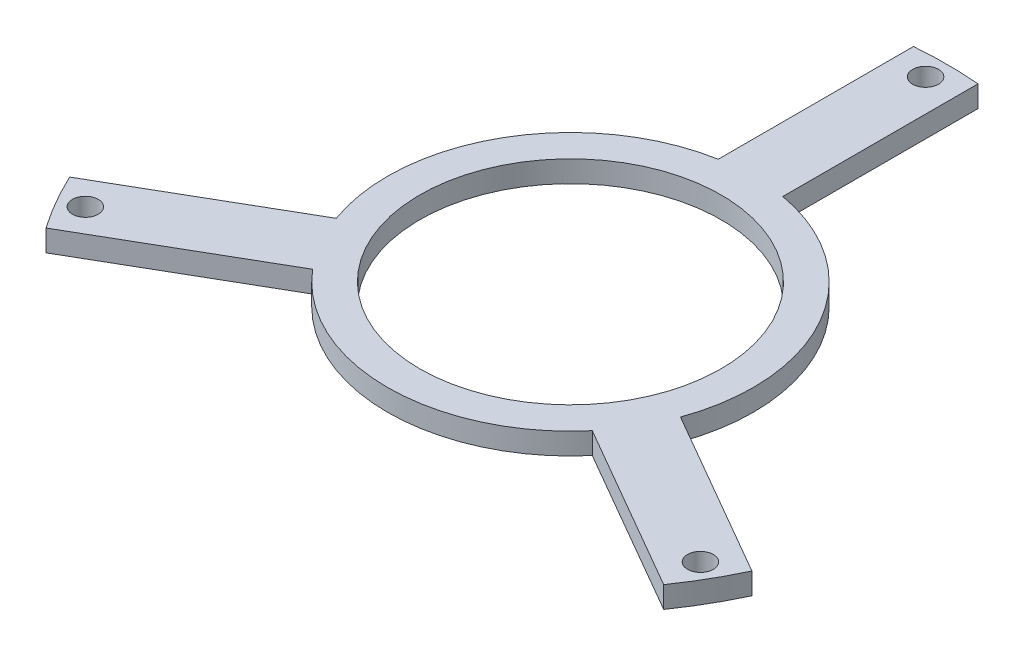
ISO-10303-21;
HEADER;
FILE_DESCRIPTION(('STEP AP214'),'2;1');
FILE_NAME('part.step','',(''),(''),'','','');
FILE_SCHEMA(('AUTOMOTIVE_DESIGN { 1 0 10303 214 1 1 1 1 }'));
ENDSEC;
DATA;
#1=APPLICATION_CONTEXT('core data for automotive mechanical design processes');
#2=APPLICATION_PROTOCOL_DEFINITION('international standard','automotive_design',2000,#1);
#3=PRODUCT_CONTEXT('',#1,'mechanical');
#4=PRODUCT('Part','Part','',(#3));
#5=PRODUCT_RELATED_PRODUCT_CATEGORY('part','',(#4));
#6=PRODUCT_DEFINITION_FORMATION('','',#4);
#7=PRODUCT_DEFINITION_CONTEXT('part definition',#1,'design');
#8=PRODUCT_DEFINITION('design','',#6,#7);
#9=PRODUCT_DEFINITION_SHAPE('','',#8);
#10=(LENGTH_UNIT() NAMED_UNIT(*) SI_UNIT(.MILLI.,.METRE.));
#11=(NAMED_UNIT(*) PLANE_ANGLE_UNIT() SI_UNIT($,.RADIAN.));
#12=(NAMED_UNIT(*) SI_UNIT($,.STERADIAN.) SOLID_ANGLE_UNIT());
#13=UNCERTAINTY_MEASURE_WITH_UNIT(LENGTH_MEASURE(1.E-05),#10,'distance_accuracy_value','');
#14=(GEOMETRIC_REPRESENTATION_CONTEXT(3) GLOBAL_UNCERTAINTY_ASSIGNED_CONTEXT((#13)) GLOBAL_UNIT_ASSIGNED_CONTEXT((#10,
#11,#12)) REPRESENTATION_CONTEXT('',''));
#15=CARTESIAN_POINT('',(0.,0.,0.));
#16=DIRECTION('',(0.,0.,1.));
#17=DIRECTION('',(1.,0.,0.));
#18=AXIS2_PLACEMENT_3D('',#15,#16,#17);
#19=CARTESIAN_POINT('',(0.,10.,0.));
#20=DIRECTION('',(0.,1.,0.));
#21=DIRECTION('',(0.,0.,1.));
#22=AXIS2_PLACEMENT_3D('',#19,#20,#21);
#23=PLANE('',#22);
#24=CARTESIAN_POINT('',(142.894191624441,10.,82.4999999999948));
#25=DIRECTION('',(0.,1.,0.));
#26=DIRECTION('',(0.,0.,1.));
#27=AXIS2_PLACEMENT_3D('',#24,#25,#26);
#28=CIRCLE('',#27,6.00000000000002);
#29=CARTESIAN_POINT('',(142.894191624441,10.,88.4999999999949));
#30=VERTEX_POINT('',#29);
#31=EDGE_CURVE('E294',#30,#30,#28,.T.);
#32=ORIENTED_EDGE('',*,*,#31,.F.);
#33=EDGE_LOOP('',(#32));
#34=FACE_BOUND('',#33,.T.);
#35=CARTESIAN_POINT('',(0.,10.,0.));
#36=DIRECTION('',(0.,1.,0.));
#37=DIRECTION('',(0.,0.,1.));
#38=AXIS2_PLACEMENT_3D('',#35,#36,#37);
#39=CIRCLE('',#38,70.);
#40=CARTESIAN_POINT('',(0.,10.,70.));
#41=VERTEX_POINT('',#40);
#42=EDGE_CURVE('E160',#41,#41,#39,.T.);
#43=ORIENTED_EDGE('',*,*,#42,.F.);
#44=EDGE_LOOP('',(#43));
#45=FACE_BOUND('',#44,.T.);
#46=CARTESIAN_POINT('',(0.,10.,0.));
#47=DIRECTION('',(0.,1.,0.));
#48=DIRECTION('',(0.,0.,1.));
#49=AXIS2_PLACEMENT_3D('',#46,#47,#48);
#50=CIRCLE('',#49,85.);
#51=CARTESIAN_POINT('',(79.9568837309492,10.,28.8426202699317));
#52=VERTEX_POINT('',#51);
#53=CARTESIAN_POINT('',(15.,10.,-83.6660026534076));
#54=VERTEX_POINT('',#53);
#55=EDGE_CURVE('E179',#52,#54,#50,.T.);
#56=ORIENTED_EDGE('',*,*,#55,.T.);
#57=DIRECTION('',(0.,0.,-1.));
#58=VECTOR('',#57,1.);
#59=CARTESIAN_POINT('',(15.,10.,-174.355957741627));
#60=LINE('',#59,#58);
#61=CARTESIAN_POINT('',(15.,10.,-174.355957741627));
#62=VERTEX_POINT('',#61);
#63=EDGE_CURVE('E107',#54,#62,#60,.T.);
#64=ORIENTED_EDGE('',*,*,#63,.T.);
#65=CARTESIAN_POINT('',(0.,10.,0.));
#66=DIRECTION('',(0.,1.,0.));
#67=DIRECTION('',(0.,0.,1.));
#68=AXIS2_PLACEMENT_3D('',#65,#66,#67);
#69=CIRCLE('',#68,175.);
#70=CARTESIAN_POINT('',(-15.,10.,-174.355957741627));
#71=VERTEX_POINT('',#70);
#72=EDGE_CURVE('E206',#62,#71,#69,.T.);
#73=ORIENTED_EDGE('',*,*,#72,.T.);
#74=DIRECTION('',(0.,0.,1.));
#75=VECTOR('',#74,1.);
#76=CARTESIAN_POINT('',(-15.,10.,-174.355957741627));
#77=LINE('',#76,#75);
#78=CARTESIAN_POINT('',(-15.,10.,-83.6660026534076));
#79=VERTEX_POINT('',#78);
#80=EDGE_CURVE('E225',#71,#79,#77,.T.);
#81=ORIENTED_EDGE('',*,*,#80,.T.);
#82=CARTESIAN_POINT('',(0.,10.,0.));
#83=DIRECTION('',(0.,1.,0.));
#84=DIRECTION('',(0.,0.,1.));
#85=AXIS2_PLACEMENT_3D('',#82,#83,#84);
#86=CIRCLE('',#85,85.);
#87=CARTESIAN_POINT('',(-79.9568837309453,10.,28.8426202699424));
#88=VERTEX_POINT('',#87);
#89=EDGE_CURVE('E222',#79,#88,#86,.T.);
#90=ORIENTED_EDGE('',*,*,#89,.T.);
#91=DIRECTION('',(-0.866025403784439,0.,0.5));
#92=VECTOR('',#91,1.);
#93=CARTESIAN_POINT('',(-158.496688705413,10.,74.1875978140519));
#94=LINE('',#93,#92);
#95=CARTESIAN_POINT('',(-158.496688705413,10.,74.1875978140519));
#96=VERTEX_POINT('',#95);
#97=EDGE_CURVE('E224',#88,#96,#94,.T.);
#98=ORIENTED_EDGE('',*,*,#97,.T.);
#99=CARTESIAN_POINT('',(0.,10.,0.));
#100=DIRECTION('',(0.,1.,0.));
#101=DIRECTION('',(0.,0.,1.));
#102=AXIS2_PLACEMENT_3D('',#99,#100,#101);
#103=CIRCLE('',#102,175.);
#104=CARTESIAN_POINT('',(-143.496688705412,10.,100.168359927585));
#105=VERTEX_POINT('',#104);
#106=EDGE_CURVE('E227',#96,#105,#103,.T.);
#107=ORIENTED_EDGE('',*,*,#106,.T.);
#108=DIRECTION('',(0.866025403784439,0.,-0.5));
#109=VECTOR('',#108,1.);
#110=CARTESIAN_POINT('',(-143.496688705412,10.,100.168359927585));
#111=LINE('',#110,#109);
#112=CARTESIAN_POINT('',(-64.9568837309436,10.,54.8233823834746));
#113=VERTEX_POINT('',#112);
#114=EDGE_CURVE('E233',#105,#113,#111,.T.);
#115=ORIENTED_EDGE('',*,*,#114,.T.);
#116=CARTESIAN_POINT('',(0.,10.,0.));
#117=DIRECTION('',(0.,1.,0.));
#118=DIRECTION('',(0.,0.,1.));
#119=AXIS2_PLACEMENT_3D('',#116,#117,#118);
#120=CIRCLE('',#119,85.);
#121=CARTESIAN_POINT('',(64.9568837309509,10.,54.8233823834659));
#122=VERTEX_POINT('',#121);
#123=EDGE_CURVE('E138',#113,#122,#120,.T.);
#124=ORIENTED_EDGE('',*,*,#123,.T.);
#125=DIRECTION('',(0.866025403784439,0.,0.5));
#126=VECTOR('',#125,1.);
#127=CARTESIAN_POINT('',(143.496688705418,10.,100.168359927575));
#128=LINE('',#127,#126);
#129=CARTESIAN_POINT('',(143.496688705418,10.,100.168359927575));
#130=VERTEX_POINT('',#129);
#131=EDGE_CURVE('E132',#122,#130,#128,.T.);
#132=ORIENTED_EDGE('',*,*,#131,.T.);
#133=CARTESIAN_POINT('',(0.,10.,0.));
#134=DIRECTION('',(0.,1.,0.));
#135=DIRECTION('',(0.,0.,1.));
#136=AXIS2_PLACEMENT_3D('',#133,#134,#135);
#137=CIRCLE('',#136,175.);
#138=CARTESIAN_POINT('',(158.496688705417,10.,74.1875978140416));
#139=VERTEX_POINT('',#138);
#140=EDGE_CURVE('E136',#130,#139,#137,.T.);
#141=ORIENTED_EDGE('',*,*,#140,.T.);
#142=DIRECTION('',(-0.866025403784439,0.,-0.5));
#143=VECTOR('',#142,1.);
#144=CARTESIAN_POINT('',(158.496688705417,10.,74.1875978140416));
#145=LINE('',#144,#143);
#146=EDGE_CURVE('E52',#139,#52,#145,.T.);
#147=ORIENTED_EDGE('',*,*,#146,.T.);
#148=EDGE_LOOP('',(#56,#64,#73,#81,#90,#98,#107,#115,#124,#132,#141,#147));
#149=FACE_BOUND('',#148,.T.);
#150=CARTESIAN_POINT('',(0.,10.,-165.));
#151=DIRECTION('',(0.,1.,0.));
#152=DIRECTION('',(0.,0.,1.));
#153=AXIS2_PLACEMENT_3D('',#150,#151,#152);
#154=CIRCLE('',#153,6.);
#155=CARTESIAN_POINT('',(0.,10.,-159.));
#156=VERTEX_POINT('',#155);
#157=EDGE_CURVE('E300',#156,#156,#154,.T.);
#158=ORIENTED_EDGE('',*,*,#157,.F.);
#159=EDGE_LOOP('',(#158));
#160=FACE_BOUND('',#159,.T.);
#161=CARTESIAN_POINT('',(-142.894191624423,10.,82.5000000000052));
#162=DIRECTION('',(0.,1.,0.));
#163=DIRECTION('',(0.,0.,1.));
#164=AXIS2_PLACEMENT_3D('',#161,#162,#163);
#165=CIRCLE('',#164,6.00000000000002);
#166=CARTESIAN_POINT('',(-142.894191624423,10.,88.5000000000052));
#167=VERTEX_POINT('',#166);
#168=EDGE_CURVE('E285',#167,#167,#165,.T.);
#169=ORIENTED_EDGE('',*,*,#168,.F.);
#170=EDGE_LOOP('',(#169));
#171=FACE_BOUND('',#170,.T.);
#172=ADVANCED_FACE('F35',(#34,#45,#149,#160,#171),#23,.T.);
#173=CARTESIAN_POINT('',(0.,0.,0.));
#174=DIRECTION('',(0.,1.,0.));
#175=DIRECTION('',(0.,0.,1.));
#176=AXIS2_PLACEMENT_3D('',#173,#174,#175);
#177=PLANE('',#176);
#178=CARTESIAN_POINT('',(142.894191624441,0.,82.4999999999948));
#179=DIRECTION('',(0.,1.,0.));
#180=DIRECTION('',(0.,0.,1.));
#181=AXIS2_PLACEMENT_3D('',#178,#179,#180);
#182=CIRCLE('',#181,6.00000000000002);
#183=CARTESIAN_POINT('',(142.894191624441,0.,88.4999999999949));
#184=VERTEX_POINT('',#183);
#185=EDGE_CURVE('E291',#184,#184,#182,.T.);
#186=ORIENTED_EDGE('',*,*,#185,.T.);
#187=EDGE_LOOP('',(#186));
#188=FACE_BOUND('',#187,.T.);
#189=CARTESIAN_POINT('',(0.,0.,0.));
#190=DIRECTION('',(0.,1.,0.));
#191=DIRECTION('',(0.,0.,1.));
#192=AXIS2_PLACEMENT_3D('',#189,#190,#191);
#193=CIRCLE('',#192,70.);
#194=CARTESIAN_POINT('',(0.,0.,70.));
#195=VERTEX_POINT('',#194);
#196=EDGE_CURVE('E303',#195,#195,#193,.T.);
#197=ORIENTED_EDGE('',*,*,#196,.T.);
#198=EDGE_LOOP('',(#197));
#199=FACE_BOUND('',#198,.T.);
#200=CARTESIAN_POINT('',(0.,0.,0.));
#201=DIRECTION('',(0.,1.,0.));
#202=DIRECTION('',(0.,0.,1.));
#203=AXIS2_PLACEMENT_3D('',#200,#201,#202);
#204=CIRCLE('',#203,85.);
#205=CARTESIAN_POINT('',(79.9568837309492,0.,28.8426202699317));
#206=VERTEX_POINT('',#205);
#207=CARTESIAN_POINT('',(15.,0.,-83.6660026534076));
#208=VERTEX_POINT('',#207);
#209=EDGE_CURVE('E156',#206,#208,#204,.T.);
#210=ORIENTED_EDGE('',*,*,#209,.F.);
#211=DIRECTION('',(-0.866025403784439,0.,-0.5));
#212=VECTOR('',#211,1.);
#213=CARTESIAN_POINT('',(158.496688705417,0.,74.1875978140416));
#214=LINE('',#213,#212);
#215=CARTESIAN_POINT('',(158.496688705417,0.,74.1875978140416));
#216=VERTEX_POINT('',#215);
#217=EDGE_CURVE('E99',#216,#206,#214,.T.);
#218=ORIENTED_EDGE('',*,*,#217,.F.);
#219=CARTESIAN_POINT('',(0.,0.,0.));
#220=DIRECTION('',(0.,1.,0.));
#221=DIRECTION('',(0.,0.,1.));
#222=AXIS2_PLACEMENT_3D('',#219,#220,#221);
#223=CIRCLE('',#222,175.);
#224=CARTESIAN_POINT('',(143.496688705418,0.,100.168359927575));
#225=VERTEX_POINT('',#224);
#226=EDGE_CURVE('E93',#225,#216,#223,.T.);
#227=ORIENTED_EDGE('',*,*,#226,.F.);
#228=DIRECTION('',(0.866025403784439,0.,0.5));
#229=VECTOR('',#228,1.);
#230=CARTESIAN_POINT('',(143.496688705418,0.,100.168359927575));
#231=LINE('',#230,#229);
#232=CARTESIAN_POINT('',(64.9568837309509,0.,54.8233823834659));
#233=VERTEX_POINT('',#232);
#234=EDGE_CURVE('E146',#233,#225,#231,.T.);
#235=ORIENTED_EDGE('',*,*,#234,.F.);
#236=CARTESIAN_POINT('',(0.,0.,0.));
#237=DIRECTION('',(0.,1.,0.));
#238=DIRECTION('',(0.,0.,1.));
#239=AXIS2_PLACEMENT_3D('',#236,#237,#238);
#240=CIRCLE('',#239,85.);
#241=CARTESIAN_POINT('',(-64.9568837309436,0.,54.8233823834746));
#242=VERTEX_POINT('',#241);
#243=EDGE_CURVE('E174',#242,#233,#240,.T.);
#244=ORIENTED_EDGE('',*,*,#243,.F.);
#245=DIRECTION('',(0.866025403784439,0.,-0.5));
#246=VECTOR('',#245,1.);
#247=CARTESIAN_POINT('',(-143.496688705412,0.,100.168359927585));
#248=LINE('',#247,#246);
#249=CARTESIAN_POINT('',(-143.496688705412,0.,100.168359927585));
#250=VERTEX_POINT('',#249);
#251=EDGE_CURVE('E172',#250,#242,#248,.T.);
#252=ORIENTED_EDGE('',*,*,#251,.F.);
#253=CARTESIAN_POINT('',(0.,0.,0.));
#254=DIRECTION('',(0.,1.,0.));
#255=DIRECTION('',(0.,0.,1.));
#256=AXIS2_PLACEMENT_3D('',#253,#254,#255);
#257=CIRCLE('',#256,175.);
#258=CARTESIAN_POINT('',(-158.496688705413,0.,74.1875978140519));
#259=VERTEX_POINT('',#258);
#260=EDGE_CURVE('E170',#259,#250,#257,.T.);
#261=ORIENTED_EDGE('',*,*,#260,.F.);
#262=DIRECTION('',(-0.866025403784439,0.,0.5));
#263=VECTOR('',#262,1.);
#264=CARTESIAN_POINT('',(-158.496688705413,0.,74.1875978140519));
#265=LINE('',#264,#263);
#266=CARTESIAN_POINT('',(-79.9568837309453,0.,28.8426202699424));
#267=VERTEX_POINT('',#266);
#268=EDGE_CURVE('E168',#267,#259,#265,.T.);
#269=ORIENTED_EDGE('',*,*,#268,.F.);
#270=CARTESIAN_POINT('',(0.,0.,0.));
#271=DIRECTION('',(0.,1.,0.));
#272=DIRECTION('',(0.,0.,1.));
#273=AXIS2_PLACEMENT_3D('',#270,#271,#272);
#274=CIRCLE('',#273,85.);
#275=CARTESIAN_POINT('',(-15.,0.,-83.6660026534076));
#276=VERTEX_POINT('',#275);
#277=EDGE_CURVE('E166',#276,#267,#274,.T.);
#278=ORIENTED_EDGE('',*,*,#277,.F.);
#279=DIRECTION('',(0.,0.,1.));
#280=VECTOR('',#279,1.);
#281=CARTESIAN_POINT('',(-15.,0.,-174.355957741627));
#282=LINE('',#281,#280);
#283=CARTESIAN_POINT('',(-15.,0.,-174.355957741627));
#284=VERTEX_POINT('',#283);
#285=EDGE_CURVE('E164',#284,#276,#282,.T.);
#286=ORIENTED_EDGE('',*,*,#285,.F.);
#287=CARTESIAN_POINT('',(0.,0.,0.));
#288=DIRECTION('',(0.,1.,0.));
#289=DIRECTION('',(0.,0.,1.));
#290=AXIS2_PLACEMENT_3D('',#287,#288,#289);
#291=CIRCLE('',#290,175.);
#292=CARTESIAN_POINT('',(15.,0.,-174.355957741627));
#293=VERTEX_POINT('',#292);
#294=EDGE_CURVE('E162',#293,#284,#291,.T.);
#295=ORIENTED_EDGE('',*,*,#294,.F.);
#296=DIRECTION('',(0.,0.,-1.));
#297=VECTOR('',#296,1.);
#298=CARTESIAN_POINT('',(15.,0.,-174.355957741627));
#299=LINE('',#298,#297);
#300=EDGE_CURVE('E159',#208,#293,#299,.T.);
#301=ORIENTED_EDGE('',*,*,#300,.F.);
#302=EDGE_LOOP('',(#210,#218,#227,#235,#244,#252,#261,#269,#278,#286,#295,#301));
#303=FACE_BOUND('',#302,.T.);
#304=CARTESIAN_POINT('',(0.,0.,-165.));
#305=DIRECTION('',(0.,1.,0.));
#306=DIRECTION('',(0.,0.,1.));
#307=AXIS2_PLACEMENT_3D('',#304,#305,#306);
#308=CIRCLE('',#307,6.);
#309=CARTESIAN_POINT('',(0.,0.,-159.));
#310=VERTEX_POINT('',#309);
#311=EDGE_CURVE('E297',#310,#310,#308,.T.);
#312=ORIENTED_EDGE('',*,*,#311,.T.);
#313=EDGE_LOOP('',(#312));
#314=FACE_BOUND('',#313,.T.);
#315=CARTESIAN_POINT('',(-142.894191624423,0.,82.5000000000052));
#316=DIRECTION('',(0.,1.,0.));
#317=DIRECTION('',(0.,0.,1.));
#318=AXIS2_PLACEMENT_3D('',#315,#316,#317);
#319=CIRCLE('',#318,6.00000000000002);
#320=CARTESIAN_POINT('',(-142.894191624423,0.,88.5000000000052));
#321=VERTEX_POINT('',#320);
#322=EDGE_CURVE('E288',#321,#321,#319,.T.);
#323=ORIENTED_EDGE('',*,*,#322,.T.);
#324=EDGE_LOOP('',(#323));
#325=FACE_BOUND('',#324,.T.);
#326=ADVANCED_FACE('F210',(#188,#199,#303,#314,#325),#177,.F.);
#327=CARTESIAN_POINT('',(0.,10.,0.));
#328=DIRECTION('',(0.,-1.,0.));
#329=DIRECTION('',(0.,0.,-1.));
#330=AXIS2_PLACEMENT_3D('',#327,#328,#329);
#331=CYLINDRICAL_SURFACE('',#330,85.);
#332=ORIENTED_EDGE('',*,*,#209,.T.);
#333=DIRECTION('',(0.,-1.,0.));
#334=VECTOR('',#333,1.);
#335=CARTESIAN_POINT('',(15.,10.,-83.6660026534076));
#336=LINE('',#335,#334);
#337=EDGE_CURVE('E11',#54,#208,#336,.T.);
#338=ORIENTED_EDGE('',*,*,#337,.F.);
#339=ORIENTED_EDGE('',*,*,#55,.F.);
#340=DIRECTION('',(0.,-1.,0.));
#341=VECTOR('',#340,1.);
#342=CARTESIAN_POINT('',(79.9568837309492,10.,28.8426202699317));
#343=LINE('',#342,#341);
#344=EDGE_CURVE('E152',#52,#206,#343,.T.);
#345=ORIENTED_EDGE('',*,*,#344,.T.);
#346=EDGE_LOOP('',(#332,#338,#339,#345));
#347=FACE_BOUND('',#346,.T.);
#348=ADVANCED_FACE('F37',(#347),#331,.T.);
#349=CARTESIAN_POINT('',(15.,10.,-174.355957741627));
#350=DIRECTION('',(-1.,0.,0.));
#351=DIRECTION('',(0.,0.,1.));
#352=AXIS2_PLACEMENT_3D('',#349,#350,#351);
#353=PLANE('',#352);
#354=ORIENTED_EDGE('',*,*,#300,.T.);
#355=DIRECTION('',(0.,-1.,0.));
#356=VECTOR('',#355,1.);
#357=CARTESIAN_POINT('',(15.,10.,-174.355957741627));
#358=LINE('',#357,#356);
#359=EDGE_CURVE('E44',#62,#293,#358,.T.);
#360=ORIENTED_EDGE('',*,*,#359,.F.);
#361=ORIENTED_EDGE('',*,*,#63,.F.);
#362=ORIENTED_EDGE('',*,*,#337,.T.);
#363=EDGE_LOOP('',(#354,#360,#361,#362));
#364=FACE_BOUND('',#363,.T.);
#365=ADVANCED_FACE('F412',(#364),#353,.F.);
#366=CARTESIAN_POINT('',(0.,10.,0.));
#367=DIRECTION('',(0.,-1.,0.));
#368=DIRECTION('',(0.,0.,-1.));
#369=AXIS2_PLACEMENT_3D('',#366,#367,#368);
#370=CYLINDRICAL_SURFACE('',#369,175.);
#371=ORIENTED_EDGE('',*,*,#294,.T.);
#372=DIRECTION('',(0.,-1.,0.));
#373=VECTOR('',#372,1.);
#374=CARTESIAN_POINT('',(-15.,10.,-174.355957741627));
#375=LINE('',#374,#373);
#376=EDGE_CURVE('E198',#71,#284,#375,.T.);
#377=ORIENTED_EDGE('',*,*,#376,.F.);
#378=ORIENTED_EDGE('',*,*,#72,.F.);
#379=ORIENTED_EDGE('',*,*,#359,.T.);
#380=EDGE_LOOP('',(#371,#377,#378,#379));
#381=FACE_BOUND('',#380,.T.);
#382=ADVANCED_FACE('F204',(#381),#370,.T.);
#383=CARTESIAN_POINT('',(-15.,10.,-174.355957741627));
#384=DIRECTION('',(1.,0.,0.));
#385=DIRECTION('',(0.,0.,-1.));
#386=AXIS2_PLACEMENT_3D('',#383,#384,#385);
#387=PLANE('',#386);
#388=ORIENTED_EDGE('',*,*,#285,.T.);
#389=DIRECTION('',(0.,-1.,0.));
#390=VECTOR('',#389,1.);
#391=CARTESIAN_POINT('',(-15.,10.,-83.6660026534076));
#392=LINE('',#391,#390);
#393=EDGE_CURVE('E195',#79,#276,#392,.T.);
#394=ORIENTED_EDGE('',*,*,#393,.F.);
#395=ORIENTED_EDGE('',*,*,#80,.F.);
#396=ORIENTED_EDGE('',*,*,#376,.T.);
#397=EDGE_LOOP('',(#388,#394,#395,#396));
#398=FACE_BOUND('',#397,.T.);
#399=ADVANCED_FACE('F216',(#398),#387,.F.);
#400=CARTESIAN_POINT('',(0.,10.,0.));
#401=DIRECTION('',(0.,-1.,0.));
#402=DIRECTION('',(0.,0.,-1.));
#403=AXIS2_PLACEMENT_3D('',#400,#401,#402);
#404=CYLINDRICAL_SURFACE('',#403,85.);
#405=ORIENTED_EDGE('',*,*,#277,.T.);
#406=DIRECTION('',(0.,-1.,0.));
#407=VECTOR('',#406,1.);
#408=CARTESIAN_POINT('',(-79.9568837309453,10.,28.8426202699424));
#409=LINE('',#408,#407);
#410=EDGE_CURVE('E192',#88,#267,#409,.T.);
#411=ORIENTED_EDGE('',*,*,#410,.F.);
#412=ORIENTED_EDGE('',*,*,#89,.F.);
#413=ORIENTED_EDGE('',*,*,#393,.T.);
#414=EDGE_LOOP('',(#405,#411,#412,#413));
#415=FACE_BOUND('',#414,.T.);
#416=ADVANCED_FACE('F220',(#415),#404,.T.);
#417=CARTESIAN_POINT('',(-158.496688705413,10.,74.1875978140519));
#418=DIRECTION('',(0.5,0.,0.866025403784439));
#419=DIRECTION('',(0.866025403784439,0.,-0.5));
#420=AXIS2_PLACEMENT_3D('',#417,#418,#419);
#421=PLANE('',#420);
#422=ORIENTED_EDGE('',*,*,#268,.T.);
#423=DIRECTION('',(0.,-1.,0.));
#424=VECTOR('',#423,1.);
#425=CARTESIAN_POINT('',(-158.496688705413,10.,74.1875978140519));
#426=LINE('',#425,#424);
#427=EDGE_CURVE('E189',#96,#259,#426,.T.);
#428=ORIENTED_EDGE('',*,*,#427,.F.);
#429=ORIENTED_EDGE('',*,*,#97,.F.);
#430=ORIENTED_EDGE('',*,*,#410,.T.);
#431=EDGE_LOOP('',(#422,#428,#429,#430));
#432=FACE_BOUND('',#431,.T.);
#433=ADVANCED_FACE('F377',(#432),#421,.F.);
#434=CARTESIAN_POINT('',(0.,10.,0.));
#435=DIRECTION('',(0.,-1.,0.));
#436=DIRECTION('',(0.,0.,-1.));
#437=AXIS2_PLACEMENT_3D('',#434,#435,#436);
#438=CYLINDRICAL_SURFACE('',#437,175.);
#439=ORIENTED_EDGE('',*,*,#260,.T.);
#440=DIRECTION('',(0.,-1.,0.));
#441=VECTOR('',#440,1.);
#442=CARTESIAN_POINT('',(-143.496688705412,10.,100.168359927585));
#443=LINE('',#442,#441);
#444=EDGE_CURVE('E186',#105,#250,#443,.T.);
#445=ORIENTED_EDGE('',*,*,#444,.F.);
#446=ORIENTED_EDGE('',*,*,#106,.F.);
#447=ORIENTED_EDGE('',*,*,#427,.T.);
#448=EDGE_LOOP('',(#439,#445,#446,#447));
#449=FACE_BOUND('',#448,.T.);
#450=ADVANCED_FACE('F368',(#449),#438,.T.);
#451=CARTESIAN_POINT('',(-143.496688705412,10.,100.168359927585));
#452=DIRECTION('',(-0.5,0.,-0.866025403784439));
#453=DIRECTION('',(-0.866025403784439,0.,0.5));
#454=AXIS2_PLACEMENT_3D('',#451,#452,#453);
#455=PLANE('',#454);
#456=ORIENTED_EDGE('',*,*,#251,.T.);
#457=DIRECTION('',(0.,-1.,0.));
#458=VECTOR('',#457,1.);
#459=CARTESIAN_POINT('',(-64.9568837309436,10.,54.8233823834746));
#460=LINE('',#459,#458);
#461=EDGE_CURVE('E183',#113,#242,#460,.T.);
#462=ORIENTED_EDGE('',*,*,#461,.F.);
#463=ORIENTED_EDGE('',*,*,#114,.F.);
#464=ORIENTED_EDGE('',*,*,#444,.T.);
#465=EDGE_LOOP('',(#456,#462,#463,#464));
#466=FACE_BOUND('',#465,.T.);
#467=ADVANCED_FACE('F239',(#466),#455,.F.);
#468=CARTESIAN_POINT('',(0.,10.,0.));
#469=DIRECTION('',(0.,-1.,0.));
#470=DIRECTION('',(0.,0.,-1.));
#471=AXIS2_PLACEMENT_3D('',#468,#469,#470);
#472=CYLINDRICAL_SURFACE('',#471,85.);
#473=ORIENTED_EDGE('',*,*,#243,.T.);
#474=DIRECTION('',(0.,-1.,0.));
#475=VECTOR('',#474,1.);
#476=CARTESIAN_POINT('',(64.9568837309509,10.,54.8233823834659));
#477=LINE('',#476,#475);
#478=EDGE_CURVE('E147',#122,#233,#477,.T.);
#479=ORIENTED_EDGE('',*,*,#478,.F.);
#480=ORIENTED_EDGE('',*,*,#123,.F.);
#481=ORIENTED_EDGE('',*,*,#461,.T.);
#482=EDGE_LOOP('',(#473,#479,#480,#481));
#483=FACE_BOUND('',#482,.T.);
#484=ADVANCED_FACE('F243',(#483),#472,.T.);
#485=CARTESIAN_POINT('',(143.496688705418,10.,100.168359927575));
#486=DIRECTION('',(0.5,0.,-0.866025403784439));
#487=DIRECTION('',(-0.866025403784439,0.,-0.5));
#488=AXIS2_PLACEMENT_3D('',#485,#486,#487);
#489=PLANE('',#488);
#490=ORIENTED_EDGE('',*,*,#234,.T.);
#491=DIRECTION('',(0.,-1.,0.));
#492=VECTOR('',#491,1.);
#493=CARTESIAN_POINT('',(143.496688705418,10.,100.168359927575));
#494=LINE('',#493,#492);
#495=EDGE_CURVE('E143',#130,#225,#494,.T.);
#496=ORIENTED_EDGE('',*,*,#495,.F.);
#497=ORIENTED_EDGE('',*,*,#131,.F.);
#498=ORIENTED_EDGE('',*,*,#478,.T.);
#499=EDGE_LOOP('',(#490,#496,#497,#498));
#500=FACE_BOUND('',#499,.T.);
#501=ADVANCED_FACE('F144',(#500),#489,.F.);
#502=CARTESIAN_POINT('',(0.,10.,0.));
#503=DIRECTION('',(0.,-1.,0.));
#504=DIRECTION('',(0.,0.,-1.));
#505=AXIS2_PLACEMENT_3D('',#502,#503,#504);
#506=CYLINDRICAL_SURFACE('',#505,175.);
#507=ORIENTED_EDGE('',*,*,#226,.T.);
#508=DIRECTION('',(0.,-1.,0.));
#509=VECTOR('',#508,1.);
#510=CARTESIAN_POINT('',(158.496688705417,10.,74.1875978140416));
#511=LINE('',#510,#509);
#512=EDGE_CURVE('E148',#139,#216,#511,.T.);
#513=ORIENTED_EDGE('',*,*,#512,.F.);
#514=ORIENTED_EDGE('',*,*,#140,.F.);
#515=ORIENTED_EDGE('',*,*,#495,.T.);
#516=EDGE_LOOP('',(#507,#513,#514,#515));
#517=FACE_BOUND('',#516,.T.);
#518=ADVANCED_FACE('F150',(#517),#506,.T.);
#519=CARTESIAN_POINT('',(158.496688705417,10.,74.1875978140416));
#520=DIRECTION('',(-0.5,0.,0.866025403784439));
#521=DIRECTION('',(0.866025403784439,0.,0.5));
#522=AXIS2_PLACEMENT_3D('',#519,#520,#521);
#523=PLANE('',#522);
#524=ORIENTED_EDGE('',*,*,#217,.T.);
#525=ORIENTED_EDGE('',*,*,#344,.F.);
#526=ORIENTED_EDGE('',*,*,#146,.F.);
#527=ORIENTED_EDGE('',*,*,#512,.T.);
#528=EDGE_LOOP('',(#524,#525,#526,#527));
#529=FACE_BOUND('',#528,.T.);
#530=ADVANCED_FACE('F247',(#529),#523,.F.);
#531=CARTESIAN_POINT('',(0.,10.,0.));
#532=DIRECTION('',(0.,-1.,0.));
#533=DIRECTION('',(0.,0.,-1.));
#534=AXIS2_PLACEMENT_3D('',#531,#532,#533);
#535=CYLINDRICAL_SURFACE('',#534,70.);
#536=ORIENTED_EDGE('',*,*,#42,.T.);
#537=EDGE_LOOP('',(#536));
#538=FACE_BOUND('',#537,.T.);
#539=ORIENTED_EDGE('',*,*,#196,.F.);
#540=EDGE_LOOP('',(#539));
#541=FACE_BOUND('',#540,.T.);
#542=ADVANCED_FACE('F249',(#538,#541),#535,.F.);
#543=CARTESIAN_POINT('',(0.,10.,-165.));
#544=DIRECTION('',(0.,-1.,0.));
#545=DIRECTION('',(0.,0.,-1.));
#546=AXIS2_PLACEMENT_3D('',#543,#544,#545);
#547=CYLINDRICAL_SURFACE('',#546,6.);
#548=ORIENTED_EDGE('',*,*,#157,.T.);
#549=EDGE_LOOP('',(#548));
#550=FACE_BOUND('',#549,.T.);
#551=ORIENTED_EDGE('',*,*,#311,.F.);
#552=EDGE_LOOP('',(#551));
#553=FACE_BOUND('',#552,.T.);
#554=ADVANCED_FACE('F255',(#550,#553),#547,.F.);
#555=CARTESIAN_POINT('',(142.894191624441,10.,82.4999999999948));
#556=DIRECTION('',(0.,-1.,0.));
#557=DIRECTION('',(0.,0.,-1.));
#558=AXIS2_PLACEMENT_3D('',#555,#556,#557);
#559=CYLINDRICAL_SURFACE('',#558,6.00000000000002);
#560=ORIENTED_EDGE('',*,*,#31,.T.);
#561=EDGE_LOOP('',(#560));
#562=FACE_BOUND('',#561,.T.);
#563=ORIENTED_EDGE('',*,*,#185,.F.);
#564=EDGE_LOOP('',(#563));
#565=FACE_BOUND('',#564,.T.);
#566=ADVANCED_FACE('F272',(#562,#565),#559,.F.);
#567=CARTESIAN_POINT('',(-142.894191624423,10.,82.5000000000052));
#568=DIRECTION('',(0.,-1.,0.));
#569=DIRECTION('',(0.,0.,-1.));
#570=AXIS2_PLACEMENT_3D('',#567,#568,#569);
#571=CYLINDRICAL_SURFACE('',#570,6.00000000000002);
#572=ORIENTED_EDGE('',*,*,#168,.T.);
#573=EDGE_LOOP('',(#572));
#574=FACE_BOUND('',#573,.T.);
#575=ORIENTED_EDGE('',*,*,#322,.F.);
#576=EDGE_LOOP('',(#575));
#577=FACE_BOUND('',#576,.T.);
#578=ADVANCED_FACE('F276',(#574,#577),#571,.F.);
#579=CLOSED_SHELL('',(#172,#326,#348,#365,#382,#399,#416,#433,#450,#467,#484,#501,#518,#530,
#542,#554,#566,#578));
#580=MANIFOLD_SOLID_BREP('B2',#579);
#581=ADVANCED_BREP_SHAPE_REPRESENTATION('',(#18,#580),#14);
#582=SHAPE_DEFINITION_REPRESENTATION(#9,#581);
ENDSEC;
END-ISO-10303-21;
